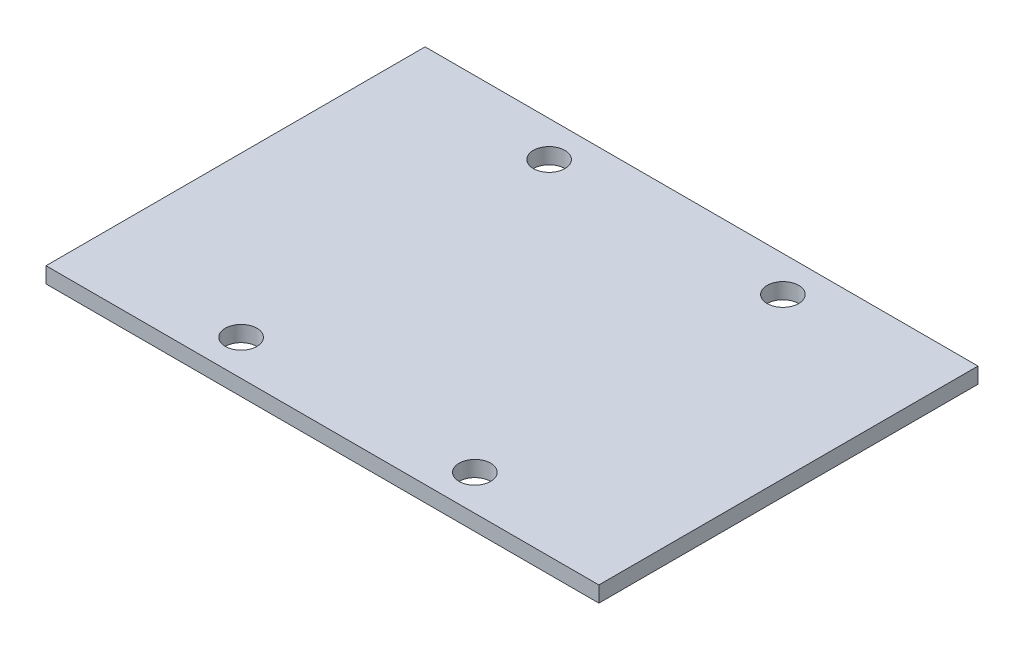
ISO-10303-21;
HEADER;
FILE_DESCRIPTION(('STEP AP214'),'2;1');
FILE_NAME('part.step','',(''),(''),'','','');
FILE_SCHEMA(('AUTOMOTIVE_DESIGN { 1 0 10303 214 1 1 1 1 }'));
ENDSEC;
DATA;
#1=APPLICATION_CONTEXT('core data for automotive mechanical design processes');
#2=APPLICATION_PROTOCOL_DEFINITION('international standard','automotive_design',2000,#1);
#3=PRODUCT_CONTEXT('',#1,'mechanical');
#4=PRODUCT('Part','Part','',(#3));
#5=PRODUCT_RELATED_PRODUCT_CATEGORY('part','',(#4));
#6=PRODUCT_DEFINITION_FORMATION('','',#4);
#7=PRODUCT_DEFINITION_CONTEXT('part definition',#1,'design');
#8=PRODUCT_DEFINITION('design','',#6,#7);
#9=PRODUCT_DEFINITION_SHAPE('','',#8);
#10=(LENGTH_UNIT() NAMED_UNIT(*) SI_UNIT(.MILLI.,.METRE.));
#11=(NAMED_UNIT(*) PLANE_ANGLE_UNIT() SI_UNIT($,.RADIAN.));
#12=(NAMED_UNIT(*) SI_UNIT($,.STERADIAN.) SOLID_ANGLE_UNIT());
#13=UNCERTAINTY_MEASURE_WITH_UNIT(LENGTH_MEASURE(1.E-05),#10,'distance_accuracy_value','');
#14=(GEOMETRIC_REPRESENTATION_CONTEXT(3) GLOBAL_UNCERTAINTY_ASSIGNED_CONTEXT((#13)) GLOBAL_UNIT_ASSIGNED_CONTEXT((#10,
#11,#12)) REPRESENTATION_CONTEXT('',''));
#15=CARTESIAN_POINT('',(0.,0.,0.));
#16=DIRECTION('',(0.,0.,1.));
#17=DIRECTION('',(1.,0.,0.));
#18=AXIS2_PLACEMENT_3D('',#15,#16,#17);
#19=CARTESIAN_POINT('',(0.,2.,0.));
#20=DIRECTION('',(0.,1.,0.));
#21=DIRECTION('',(0.,0.,1.));
#22=AXIS2_PLACEMENT_3D('',#19,#20,#21);
#23=PLANE('',#22);
#24=CARTESIAN_POINT('',(14.8,2.,-31.5));
#25=DIRECTION('',(0.,1.,0.));
#26=DIRECTION('',(0.,0.,1.));
#27=AXIS2_PLACEMENT_3D('',#24,#25,#26);
#28=CIRCLE('',#27,2.);
#29=CARTESIAN_POINT('',(14.8,2.,-29.5));
#30=VERTEX_POINT('',#29);
#31=EDGE_CURVE('E175',#30,#30,#28,.T.);
#32=ORIENTED_EDGE('',*,*,#31,.F.);
#33=EDGE_LOOP('',(#32));
#34=FACE_BOUND('',#33,.T.);
#35=CARTESIAN_POINT('',(-14.8,2.,7.5));
#36=DIRECTION('',(0.,1.,0.));
#37=DIRECTION('',(0.,0.,1.));
#38=AXIS2_PLACEMENT_3D('',#35,#36,#37);
#39=CIRCLE('',#38,2.);
#40=CARTESIAN_POINT('',(-14.8,2.,9.5));
#41=VERTEX_POINT('',#40);
#42=EDGE_CURVE('E111',#41,#41,#39,.T.);
#43=ORIENTED_EDGE('',*,*,#42,.F.);
#44=EDGE_LOOP('',(#43));
#45=FACE_BOUND('',#44,.T.);
#46=DIRECTION('',(1.,0.,0.));
#47=VECTOR('',#46,1.);
#48=CARTESIAN_POINT('',(35.,2.,12.));
#49=LINE('',#48,#47);
#50=CARTESIAN_POINT('',(-35.,2.,12.));
#51=VERTEX_POINT('',#50);
#52=CARTESIAN_POINT('',(35.,2.,12.));
#53=VERTEX_POINT('',#52);
#54=EDGE_CURVE('E57',#51,#53,#49,.T.);
#55=ORIENTED_EDGE('',*,*,#54,.T.);
#56=DIRECTION('',(0.,0.,-1.));
#57=VECTOR('',#56,1.);
#58=CARTESIAN_POINT('',(35.,2.,-36.));
#59=LINE('',#58,#57);
#60=CARTESIAN_POINT('',(35.,2.,-36.));
#61=VERTEX_POINT('',#60);
#62=EDGE_CURVE('E88',#53,#61,#59,.T.);
#63=ORIENTED_EDGE('',*,*,#62,.T.);
#64=DIRECTION('',(-1.,0.,0.));
#65=VECTOR('',#64,1.);
#66=CARTESIAN_POINT('',(20.,2.,-36.));
#67=LINE('',#66,#65);
#68=CARTESIAN_POINT('',(-35.,2.,-36.));
#69=VERTEX_POINT('',#68);
#70=EDGE_CURVE('E92',#61,#69,#67,.T.);
#71=ORIENTED_EDGE('',*,*,#70,.T.);
#72=DIRECTION('',(0.,0.,1.));
#73=VECTOR('',#72,1.);
#74=CARTESIAN_POINT('',(-35.,2.,-36.));
#75=LINE('',#74,#73);
#76=EDGE_CURVE('E102',#69,#51,#75,.T.);
#77=ORIENTED_EDGE('',*,*,#76,.T.);
#78=EDGE_LOOP('',(#55,#63,#71,#77));
#79=FACE_BOUND('',#78,.T.);
#80=CARTESIAN_POINT('',(14.8,2.,7.5));
#81=DIRECTION('',(0.,1.,0.));
#82=DIRECTION('',(0.,0.,-1.));
#83=AXIS2_PLACEMENT_3D('',#80,#81,#82);
#84=CIRCLE('',#83,2.);
#85=CARTESIAN_POINT('',(14.8,2.,5.5));
#86=VERTEX_POINT('',#85);
#87=EDGE_CURVE('E183',#86,#86,#84,.T.);
#88=ORIENTED_EDGE('',*,*,#87,.F.);
#89=EDGE_LOOP('',(#88));
#90=FACE_BOUND('',#89,.T.);
#91=CARTESIAN_POINT('',(-14.8,2.,-31.5));
#92=DIRECTION('',(0.,1.,0.));
#93=DIRECTION('',(0.,0.,-1.));
#94=AXIS2_PLACEMENT_3D('',#91,#92,#93);
#95=CIRCLE('',#94,2.);
#96=CARTESIAN_POINT('',(-14.8,2.,-33.5));
#97=VERTEX_POINT('',#96);
#98=EDGE_CURVE('E164',#97,#97,#95,.T.);
#99=ORIENTED_EDGE('',*,*,#98,.F.);
#100=EDGE_LOOP('',(#99));
#101=FACE_BOUND('',#100,.T.);
#102=ADVANCED_FACE('F39',(#34,#45,#79,#90,#101),#23,.T.);
#103=CARTESIAN_POINT('',(0.,0.,0.));
#104=DIRECTION('',(0.,1.,0.));
#105=DIRECTION('',(0.,0.,1.));
#106=AXIS2_PLACEMENT_3D('',#103,#104,#105);
#107=PLANE('',#106);
#108=DIRECTION('',(0.,0.,-1.));
#109=VECTOR('',#108,1.);
#110=CARTESIAN_POINT('',(35.,0.,-36.));
#111=LINE('',#110,#109);
#112=CARTESIAN_POINT('',(35.,0.,12.));
#113=VERTEX_POINT('',#112);
#114=CARTESIAN_POINT('',(35.,0.,-36.));
#115=VERTEX_POINT('',#114);
#116=EDGE_CURVE('E96',#113,#115,#111,.T.);
#117=ORIENTED_EDGE('',*,*,#116,.F.);
#118=DIRECTION('',(1.,0.,0.));
#119=VECTOR('',#118,1.);
#120=CARTESIAN_POINT('',(20.,0.,12.));
#121=LINE('',#120,#119);
#122=CARTESIAN_POINT('',(-35.,0.,12.));
#123=VERTEX_POINT('',#122);
#124=EDGE_CURVE('E81',#123,#113,#121,.T.);
#125=ORIENTED_EDGE('',*,*,#124,.F.);
#126=DIRECTION('',(0.,0.,1.));
#127=VECTOR('',#126,1.);
#128=CARTESIAN_POINT('',(-35.,0.,-36.));
#129=LINE('',#128,#127);
#130=CARTESIAN_POINT('',(-35.,0.,-36.));
#131=VERTEX_POINT('',#130);
#132=EDGE_CURVE('E114',#131,#123,#129,.T.);
#133=ORIENTED_EDGE('',*,*,#132,.F.);
#134=DIRECTION('',(-1.,0.,0.));
#135=VECTOR('',#134,1.);
#136=CARTESIAN_POINT('',(-20.,0.,-36.));
#137=LINE('',#136,#135);
#138=EDGE_CURVE('E74',#115,#131,#137,.T.);
#139=ORIENTED_EDGE('',*,*,#138,.F.);
#140=EDGE_LOOP('',(#117,#125,#133,#139));
#141=FACE_BOUND('',#140,.T.);
#142=CARTESIAN_POINT('',(-14.8,0.,7.5));
#143=DIRECTION('',(0.,1.,0.));
#144=DIRECTION('',(0.,0.,1.));
#145=AXIS2_PLACEMENT_3D('',#142,#143,#144);
#146=CIRCLE('',#145,2.);
#147=CARTESIAN_POINT('',(-14.8,0.,9.5));
#148=VERTEX_POINT('',#147);
#149=EDGE_CURVE('E187',#148,#148,#146,.T.);
#150=ORIENTED_EDGE('',*,*,#149,.T.);
#151=EDGE_LOOP('',(#150));
#152=FACE_BOUND('',#151,.T.);
#153=CARTESIAN_POINT('',(14.8,0.,7.5));
#154=DIRECTION('',(0.,1.,0.));
#155=DIRECTION('',(0.,0.,-1.));
#156=AXIS2_PLACEMENT_3D('',#153,#154,#155);
#157=CIRCLE('',#156,2.);
#158=CARTESIAN_POINT('',(14.8,0.,5.5));
#159=VERTEX_POINT('',#158);
#160=EDGE_CURVE('E179',#159,#159,#157,.T.);
#161=ORIENTED_EDGE('',*,*,#160,.T.);
#162=EDGE_LOOP('',(#161));
#163=FACE_BOUND('',#162,.T.);
#164=CARTESIAN_POINT('',(14.8,0.,-31.5));
#165=DIRECTION('',(0.,1.,0.));
#166=DIRECTION('',(0.,0.,1.));
#167=AXIS2_PLACEMENT_3D('',#164,#165,#166);
#168=CIRCLE('',#167,2.);
#169=CARTESIAN_POINT('',(14.8,0.,-29.5));
#170=VERTEX_POINT('',#169);
#171=EDGE_CURVE('E172',#170,#170,#168,.T.);
#172=ORIENTED_EDGE('',*,*,#171,.T.);
#173=EDGE_LOOP('',(#172));
#174=FACE_BOUND('',#173,.T.);
#175=CARTESIAN_POINT('',(-14.8,0.,-31.5));
#176=DIRECTION('',(0.,1.,0.));
#177=DIRECTION('',(0.,0.,-1.));
#178=AXIS2_PLACEMENT_3D('',#175,#176,#177);
#179=CIRCLE('',#178,2.);
#180=CARTESIAN_POINT('',(-14.8,0.,-33.5));
#181=VERTEX_POINT('',#180);
#182=EDGE_CURVE('E167',#181,#181,#179,.T.);
#183=ORIENTED_EDGE('',*,*,#182,.T.);
#184=EDGE_LOOP('',(#183));
#185=FACE_BOUND('',#184,.T.);
#186=ADVANCED_FACE('F125',(#141,#152,#163,#174,#185),#107,.F.);
#187=CARTESIAN_POINT('',(35.,2.,-36.));
#188=DIRECTION('',(-1.,0.,0.));
#189=DIRECTION('',(0.,0.,1.));
#190=AXIS2_PLACEMENT_3D('',#187,#188,#189);
#191=PLANE('',#190);
#192=ORIENTED_EDGE('',*,*,#116,.T.);
#193=DIRECTION('',(0.,-1.,0.));
#194=VECTOR('',#193,1.);
#195=CARTESIAN_POINT('',(35.,2.,-36.));
#196=LINE('',#195,#194);
#197=EDGE_CURVE('E49',#61,#115,#196,.T.);
#198=ORIENTED_EDGE('',*,*,#197,.F.);
#199=ORIENTED_EDGE('',*,*,#62,.F.);
#200=DIRECTION('',(0.,-1.,0.));
#201=VECTOR('',#200,1.);
#202=CARTESIAN_POINT('',(35.,2.,12.));
#203=LINE('',#202,#201);
#204=EDGE_CURVE('E11',#53,#113,#203,.T.);
#205=ORIENTED_EDGE('',*,*,#204,.T.);
#206=EDGE_LOOP('',(#192,#198,#199,#205));
#207=FACE_BOUND('',#206,.T.);
#208=ADVANCED_FACE('F41',(#207),#191,.F.);
#209=CARTESIAN_POINT('',(-20.,2.,-36.));
#210=DIRECTION('',(0.,0.,1.));
#211=DIRECTION('',(1.,0.,0.));
#212=AXIS2_PLACEMENT_3D('',#209,#210,#211);
#213=PLANE('',#212);
#214=ORIENTED_EDGE('',*,*,#138,.T.);
#215=DIRECTION('',(0.,-1.,0.));
#216=VECTOR('',#215,1.);
#217=CARTESIAN_POINT('',(-35.,2.,-36.));
#218=LINE('',#217,#216);
#219=EDGE_CURVE('E98',#69,#131,#218,.T.);
#220=ORIENTED_EDGE('',*,*,#219,.F.);
#221=ORIENTED_EDGE('',*,*,#70,.F.);
#222=ORIENTED_EDGE('',*,*,#197,.T.);
#223=EDGE_LOOP('',(#214,#220,#221,#222));
#224=FACE_BOUND('',#223,.T.);
#225=ADVANCED_FACE('F99',(#224),#213,.F.);
#226=CARTESIAN_POINT('',(-35.,2.,-36.));
#227=DIRECTION('',(1.,0.,0.));
#228=DIRECTION('',(0.,0.,-1.));
#229=AXIS2_PLACEMENT_3D('',#226,#227,#228);
#230=PLANE('',#229);
#231=ORIENTED_EDGE('',*,*,#132,.T.);
#232=DIRECTION('',(0.,-1.,0.));
#233=VECTOR('',#232,1.);
#234=CARTESIAN_POINT('',(-35.,2.,12.));
#235=LINE('',#234,#233);
#236=EDGE_CURVE('E105',#51,#123,#235,.T.);
#237=ORIENTED_EDGE('',*,*,#236,.F.);
#238=ORIENTED_EDGE('',*,*,#76,.F.);
#239=ORIENTED_EDGE('',*,*,#219,.T.);
#240=EDGE_LOOP('',(#231,#237,#238,#239));
#241=FACE_BOUND('',#240,.T.);
#242=ADVANCED_FACE('F123',(#241),#230,.F.);
#243=CARTESIAN_POINT('',(20.,2.,12.));
#244=DIRECTION('',(0.,0.,-1.));
#245=DIRECTION('',(-1.,0.,0.));
#246=AXIS2_PLACEMENT_3D('',#243,#244,#245);
#247=PLANE('',#246);
#248=ORIENTED_EDGE('',*,*,#124,.T.);
#249=ORIENTED_EDGE('',*,*,#204,.F.);
#250=ORIENTED_EDGE('',*,*,#54,.F.);
#251=ORIENTED_EDGE('',*,*,#236,.T.);
#252=EDGE_LOOP('',(#248,#249,#250,#251));
#253=FACE_BOUND('',#252,.T.);
#254=ADVANCED_FACE('F127',(#253),#247,.F.);
#255=CARTESIAN_POINT('',(-14.8,2.,7.5));
#256=DIRECTION('',(0.,-1.,0.));
#257=DIRECTION('',(0.,0.,-1.));
#258=AXIS2_PLACEMENT_3D('',#255,#256,#257);
#259=CYLINDRICAL_SURFACE('',#258,2.);
#260=ORIENTED_EDGE('',*,*,#42,.T.);
#261=EDGE_LOOP('',(#260));
#262=FACE_BOUND('',#261,.T.);
#263=ORIENTED_EDGE('',*,*,#149,.F.);
#264=EDGE_LOOP('',(#263));
#265=FACE_BOUND('',#264,.T.);
#266=ADVANCED_FACE('F129',(#262,#265),#259,.F.);
#267=CARTESIAN_POINT('',(14.8,2.,7.5));
#268=DIRECTION('',(0.,-1.,0.));
#269=DIRECTION('',(0.,0.,-1.));
#270=AXIS2_PLACEMENT_3D('',#267,#268,#269);
#271=CYLINDRICAL_SURFACE('',#270,2.);
#272=ORIENTED_EDGE('',*,*,#87,.T.);
#273=EDGE_LOOP('',(#272));
#274=FACE_BOUND('',#273,.T.);
#275=ORIENTED_EDGE('',*,*,#160,.F.);
#276=EDGE_LOOP('',(#275));
#277=FACE_BOUND('',#276,.T.);
#278=ADVANCED_FACE('F135',(#274,#277),#271,.F.);
#279=CARTESIAN_POINT('',(14.8,2.,-31.5));
#280=DIRECTION('',(0.,-1.,0.));
#281=DIRECTION('',(0.,0.,-1.));
#282=AXIS2_PLACEMENT_3D('',#279,#280,#281);
#283=CYLINDRICAL_SURFACE('',#282,2.);
#284=ORIENTED_EDGE('',*,*,#31,.T.);
#285=EDGE_LOOP('',(#284));
#286=FACE_BOUND('',#285,.T.);
#287=ORIENTED_EDGE('',*,*,#171,.F.);
#288=EDGE_LOOP('',(#287));
#289=FACE_BOUND('',#288,.T.);
#290=ADVANCED_FACE('F151',(#286,#289),#283,.F.);
#291=CARTESIAN_POINT('',(-14.8,2.,-31.5));
#292=DIRECTION('',(0.,-1.,0.));
#293=DIRECTION('',(0.,0.,-1.));
#294=AXIS2_PLACEMENT_3D('',#291,#292,#293);
#295=CYLINDRICAL_SURFACE('',#294,2.);
#296=ORIENTED_EDGE('',*,*,#98,.T.);
#297=EDGE_LOOP('',(#296));
#298=FACE_BOUND('',#297,.T.);
#299=ORIENTED_EDGE('',*,*,#182,.F.);
#300=EDGE_LOOP('',(#299));
#301=FACE_BOUND('',#300,.T.);
#302=ADVANCED_FACE('F155',(#298,#301),#295,.F.);
#303=CLOSED_SHELL('',(#102,#186,#208,#225,#242,#254,#266,#278,#290,#302));
#304=MANIFOLD_SOLID_BREP('B2',#303);
#305=ADVANCED_BREP_SHAPE_REPRESENTATION('',(#18,#304),#14);
#306=SHAPE_DEFINITION_REPRESENTATION(#9,#305);
ENDSEC;
END-ISO-10303-21;
